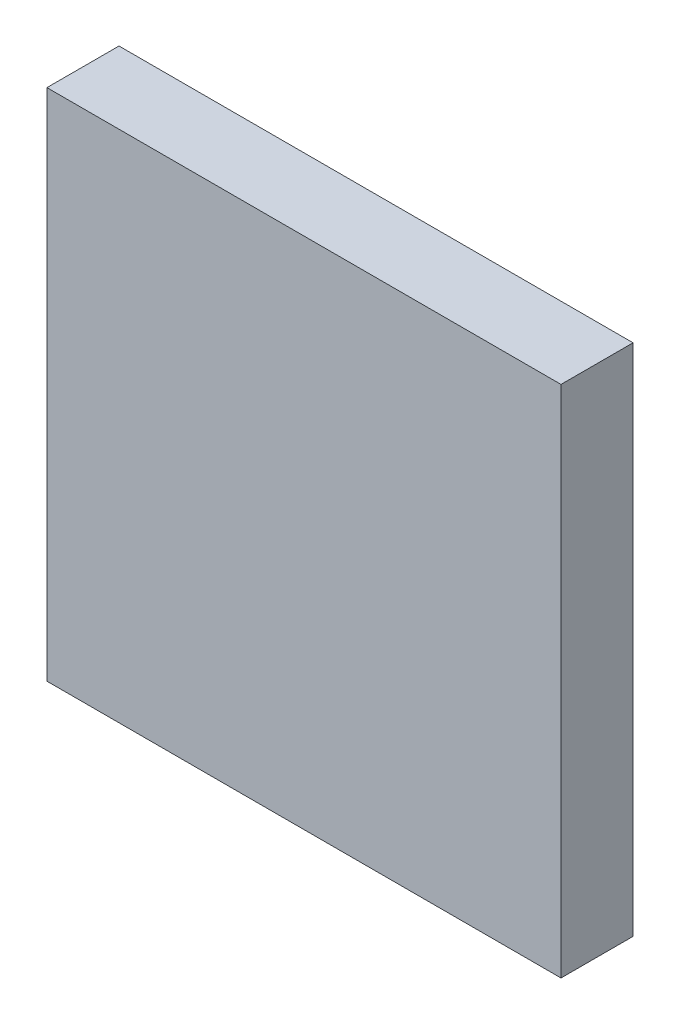
ISO-10303-21;
HEADER;
FILE_DESCRIPTION(('STEP AP214'),'2;1');
FILE_NAME('part.step','',(''),(''),'','','');
FILE_SCHEMA(('AUTOMOTIVE_DESIGN { 1 0 10303 214 1 1 1 1 }'));
ENDSEC;
DATA;
#1=APPLICATION_CONTEXT('core data for automotive mechanical design processes');
#2=APPLICATION_PROTOCOL_DEFINITION('international standard','automotive_design',2000,#1);
#3=PRODUCT_CONTEXT('',#1,'mechanical');
#4=PRODUCT('Part','Part','',(#3));
#5=PRODUCT_RELATED_PRODUCT_CATEGORY('part','',(#4));
#6=PRODUCT_DEFINITION_FORMATION('','',#4);
#7=PRODUCT_DEFINITION_CONTEXT('part definition',#1,'design');
#8=PRODUCT_DEFINITION('design','',#6,#7);
#9=PRODUCT_DEFINITION_SHAPE('','',#8);
#10=(LENGTH_UNIT() NAMED_UNIT(*) SI_UNIT(.MILLI.,.METRE.));
#11=(NAMED_UNIT(*) PLANE_ANGLE_UNIT() SI_UNIT($,.RADIAN.));
#12=(NAMED_UNIT(*) SI_UNIT($,.STERADIAN.) SOLID_ANGLE_UNIT());
#13=UNCERTAINTY_MEASURE_WITH_UNIT(LENGTH_MEASURE(1.E-05),#10,'distance_accuracy_value','');
#14=(GEOMETRIC_REPRESENTATION_CONTEXT(3) GLOBAL_UNCERTAINTY_ASSIGNED_CONTEXT((#13)) GLOBAL_UNIT_ASSIGNED_CONTEXT((#10,
#11,#12)) REPRESENTATION_CONTEXT('',''));
#15=CARTESIAN_POINT('',(0.,0.,0.));
#16=DIRECTION('',(0.,0.,1.));
#17=DIRECTION('',(1.,0.,0.));
#18=AXIS2_PLACEMENT_3D('',#15,#16,#17);
#19=CARTESIAN_POINT('',(93.7681907063322,-151.334558617317,15.));
#20=DIRECTION('',(0.,1.,0.));
#21=DIRECTION('',(0.,0.,1.));
#22=AXIS2_PLACEMENT_3D('',#19,#20,#21);
#23=PLANE('',#22);
#24=DIRECTION('',(1.,0.,0.));
#25=VECTOR('',#24,1.);
#26=CARTESIAN_POINT('',(93.7681907063322,-151.334558617317,0.));
#27=LINE('',#26,#25);
#28=CARTESIAN_POINT('',(93.7681907063322,-151.334558617317,0.));
#29=VERTEX_POINT('',#28);
#30=CARTESIAN_POINT('',(200.768190706332,-151.334558617317,0.));
#31=VERTEX_POINT('',#30);
#32=EDGE_CURVE('E99',#29,#31,#27,.T.);
#33=ORIENTED_EDGE('',*,*,#32,.T.);
#34=DIRECTION('',(0.,0.,-1.));
#35=VECTOR('',#34,1.);
#36=CARTESIAN_POINT('',(200.768190706332,-151.334558617317,15.));
#37=LINE('',#36,#35);
#38=CARTESIAN_POINT('',(200.768190706332,-151.334558617317,15.));
#39=VERTEX_POINT('',#38);
#40=EDGE_CURVE('E11',#39,#31,#37,.T.);
#41=ORIENTED_EDGE('',*,*,#40,.F.);
#42=DIRECTION('',(1.,0.,0.));
#43=VECTOR('',#42,1.);
#44=CARTESIAN_POINT('',(93.7681907063322,-151.334558617317,15.));
#45=LINE('',#44,#43);
#46=CARTESIAN_POINT('',(93.7681907063322,-151.334558617317,15.));
#47=VERTEX_POINT('',#46);
#48=EDGE_CURVE('E76',#47,#39,#45,.T.);
#49=ORIENTED_EDGE('',*,*,#48,.F.);
#50=DIRECTION('',(0.,0.,-1.));
#51=VECTOR('',#50,1.);
#52=CARTESIAN_POINT('',(93.7681907063322,-151.334558617317,15.));
#53=LINE('',#52,#51);
#54=EDGE_CURVE('E95',#47,#29,#53,.T.);
#55=ORIENTED_EDGE('',*,*,#54,.T.);
#56=EDGE_LOOP('',(#33,#41,#49,#55));
#57=FACE_BOUND('',#56,.T.);
#58=ADVANCED_FACE('F37',(#57),#23,.F.);
#59=CARTESIAN_POINT('',(200.768190706332,-44.3345586173171,15.));
#60=DIRECTION('',(1.,0.,0.));
#61=DIRECTION('',(0.,0.,-1.));
#62=AXIS2_PLACEMENT_3D('',#59,#60,#61);
#63=PLANE('',#62);
#64=DIRECTION('',(0.,-1.,0.));
#65=VECTOR('',#64,1.);
#66=CARTESIAN_POINT('',(200.768190706332,-44.3345586173171,0.));
#67=LINE('',#66,#65);
#68=CARTESIAN_POINT('',(200.768190706332,-44.3345586173171,0.));
#69=VERTEX_POINT('',#68);
#70=EDGE_CURVE('E85',#69,#31,#67,.T.);
#71=ORIENTED_EDGE('',*,*,#70,.F.);
#72=DIRECTION('',(0.,0.,-1.));
#73=VECTOR('',#72,1.);
#74=CARTESIAN_POINT('',(200.768190706332,-44.3345586173171,15.));
#75=LINE('',#74,#73);
#76=CARTESIAN_POINT('',(200.768190706332,-44.3345586173171,15.));
#77=VERTEX_POINT('',#76);
#78=EDGE_CURVE('E45',#77,#69,#75,.T.);
#79=ORIENTED_EDGE('',*,*,#78,.F.);
#80=DIRECTION('',(0.,-1.,0.));
#81=VECTOR('',#80,1.);
#82=CARTESIAN_POINT('',(200.768190706332,-44.3345586173171,15.));
#83=LINE('',#82,#81);
#84=EDGE_CURVE('E83',#77,#39,#83,.T.);
#85=ORIENTED_EDGE('',*,*,#84,.T.);
#86=ORIENTED_EDGE('',*,*,#40,.T.);
#87=EDGE_LOOP('',(#71,#79,#85,#86));
#88=FACE_BOUND('',#87,.T.);
#89=ADVANCED_FACE('F82',(#88),#63,.T.);
#90=CARTESIAN_POINT('',(93.7681907063322,-44.3345586173171,15.));
#91=DIRECTION('',(0.,1.,0.));
#92=DIRECTION('',(0.,0.,1.));
#93=AXIS2_PLACEMENT_3D('',#90,#91,#92);
#94=PLANE('',#93);
#95=DIRECTION('',(1.,0.,0.));
#96=VECTOR('',#95,1.);
#97=CARTESIAN_POINT('',(93.7681907063322,-44.3345586173171,0.));
#98=LINE('',#97,#96);
#99=CARTESIAN_POINT('',(93.7681907063322,-44.3345586173171,0.));
#100=VERTEX_POINT('',#99);
#101=EDGE_CURVE('E103',#100,#69,#98,.T.);
#102=ORIENTED_EDGE('',*,*,#101,.F.);
#103=DIRECTION('',(0.,0.,-1.));
#104=VECTOR('',#103,1.);
#105=CARTESIAN_POINT('',(93.7681907063322,-44.3345586173171,15.));
#106=LINE('',#105,#104);
#107=CARTESIAN_POINT('',(93.7681907063322,-44.3345586173171,15.));
#108=VERTEX_POINT('',#107);
#109=EDGE_CURVE('E68',#108,#100,#106,.T.);
#110=ORIENTED_EDGE('',*,*,#109,.F.);
#111=DIRECTION('',(1.,0.,0.));
#112=VECTOR('',#111,1.);
#113=CARTESIAN_POINT('',(93.7681907063322,-44.3345586173171,15.));
#114=LINE('',#113,#112);
#115=EDGE_CURVE('E91',#108,#77,#114,.T.);
#116=ORIENTED_EDGE('',*,*,#115,.T.);
#117=ORIENTED_EDGE('',*,*,#78,.T.);
#118=EDGE_LOOP('',(#102,#110,#116,#117));
#119=FACE_BOUND('',#118,.T.);
#120=ADVANCED_FACE('F93',(#119),#94,.T.);
#121=CARTESIAN_POINT('',(93.7681907063322,-44.3345586173171,15.));
#122=DIRECTION('',(1.,0.,0.));
#123=DIRECTION('',(0.,1.,0.));
#124=AXIS2_PLACEMENT_3D('',#121,#122,#123);
#125=PLANE('',#124);
#126=DIRECTION('',(0.,-1.,0.));
#127=VECTOR('',#126,1.);
#128=CARTESIAN_POINT('',(93.7681907063322,-44.3345586173171,0.));
#129=LINE('',#128,#127);
#130=EDGE_CURVE('E71',#100,#29,#129,.T.);
#131=ORIENTED_EDGE('',*,*,#130,.T.);
#132=ORIENTED_EDGE('',*,*,#54,.F.);
#133=DIRECTION('',(0.,-1.,0.));
#134=VECTOR('',#133,1.);
#135=CARTESIAN_POINT('',(93.7681907063322,-44.3345586173171,15.));
#136=LINE('',#135,#134);
#137=EDGE_CURVE('E53',#108,#47,#136,.T.);
#138=ORIENTED_EDGE('',*,*,#137,.F.);
#139=ORIENTED_EDGE('',*,*,#109,.T.);
#140=EDGE_LOOP('',(#131,#132,#138,#139));
#141=FACE_BOUND('',#140,.T.);
#142=ADVANCED_FACE('F116',(#141),#125,.F.);
#143=CARTESIAN_POINT('',(0.,0.,15.));
#144=DIRECTION('',(0.,0.,-1.));
#145=DIRECTION('',(-1.,0.,0.));
#146=AXIS2_PLACEMENT_3D('',#143,#144,#145);
#147=PLANE('',#146);
#148=ORIENTED_EDGE('',*,*,#48,.T.);
#149=ORIENTED_EDGE('',*,*,#84,.F.);
#150=ORIENTED_EDGE('',*,*,#115,.F.);
#151=ORIENTED_EDGE('',*,*,#137,.T.);
#152=EDGE_LOOP('',(#148,#149,#150,#151));
#153=FACE_BOUND('',#152,.T.);
#154=ADVANCED_FACE('F90',(#153),#147,.F.);
#155=CARTESIAN_POINT('',(0.,0.,0.));
#156=DIRECTION('',(0.,0.,-1.));
#157=DIRECTION('',(-1.,0.,0.));
#158=AXIS2_PLACEMENT_3D('',#155,#156,#157);
#159=PLANE('',#158);
#160=ORIENTED_EDGE('',*,*,#32,.F.);
#161=ORIENTED_EDGE('',*,*,#130,.F.);
#162=ORIENTED_EDGE('',*,*,#101,.T.);
#163=ORIENTED_EDGE('',*,*,#70,.T.);
#164=EDGE_LOOP('',(#160,#161,#162,#163));
#165=FACE_BOUND('',#164,.T.);
#166=ADVANCED_FACE('F110',(#165),#159,.T.);
#167=CLOSED_SHELL('',(#58,#89,#120,#142,#154,#166));
#168=MANIFOLD_SOLID_BREP('B2',#167);
#169=ADVANCED_BREP_SHAPE_REPRESENTATION('',(#18,#168),#14);
#170=SHAPE_DEFINITION_REPRESENTATION(#9,#169);
ENDSEC;
END-ISO-10303-21;
